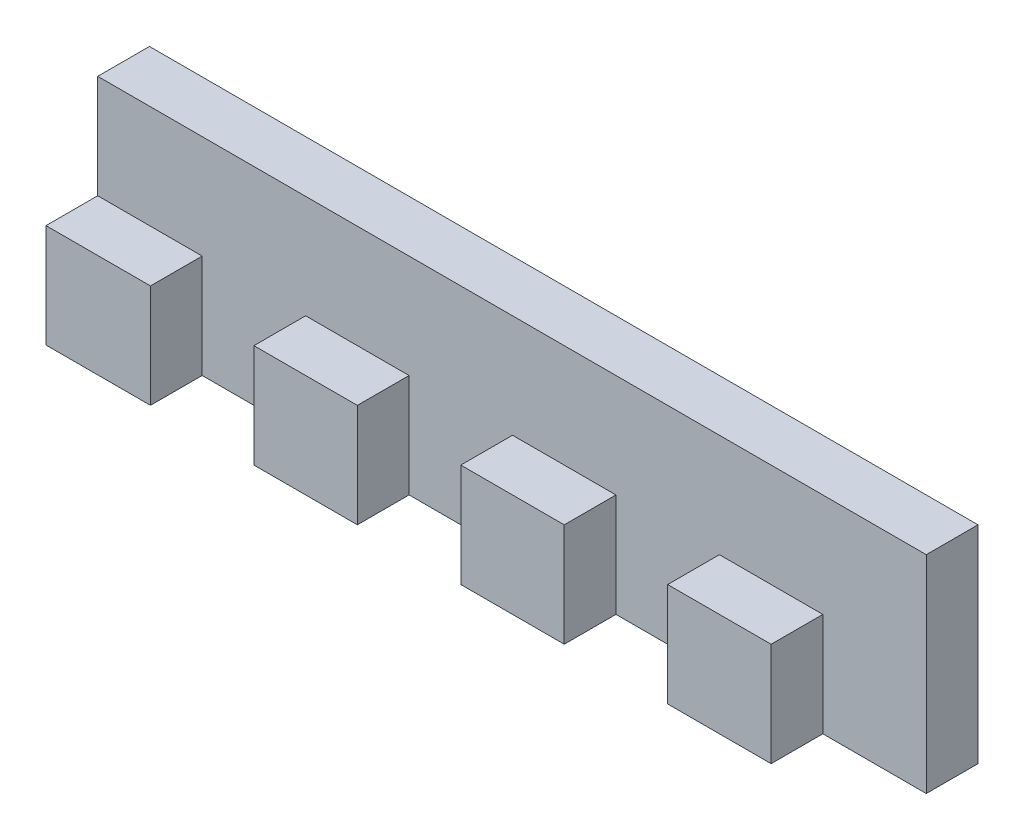
ISO-10303-21;
HEADER;
FILE_DESCRIPTION(('STEP AP214'),'2;1');
FILE_NAME('part.step','',(''),(''),'','','');
FILE_SCHEMA(('AUTOMOTIVE_DESIGN { 1 0 10303 214 1 1 1 1 }'));
ENDSEC;
DATA;
#1=APPLICATION_CONTEXT('core data for automotive mechanical design processes');
#2=APPLICATION_PROTOCOL_DEFINITION('international standard','automotive_design',2000,#1);
#3=PRODUCT_CONTEXT('',#1,'mechanical');
#4=PRODUCT('Part','Part','',(#3));
#5=PRODUCT_RELATED_PRODUCT_CATEGORY('part','',(#4));
#6=PRODUCT_DEFINITION_FORMATION('','',#4);
#7=PRODUCT_DEFINITION_CONTEXT('part definition',#1,'design');
#8=PRODUCT_DEFINITION('design','',#6,#7);
#9=PRODUCT_DEFINITION_SHAPE('','',#8);
#10=(LENGTH_UNIT() NAMED_UNIT(*) SI_UNIT(.MILLI.,.METRE.));
#11=(NAMED_UNIT(*) PLANE_ANGLE_UNIT() SI_UNIT($,.RADIAN.));
#12=(NAMED_UNIT(*) SI_UNIT($,.STERADIAN.) SOLID_ANGLE_UNIT());
#13=UNCERTAINTY_MEASURE_WITH_UNIT(LENGTH_MEASURE(1.E-05),#10,'distance_accuracy_value','');
#14=(GEOMETRIC_REPRESENTATION_CONTEXT(3) GLOBAL_UNCERTAINTY_ASSIGNED_CONTEXT((#13)) GLOBAL_UNIT_ASSIGNED_CONTEXT((#10,
#11,#12)) REPRESENTATION_CONTEXT('',''));
#15=CARTESIAN_POINT('',(0.,0.,0.));
#16=DIRECTION('',(0.,0.,1.));
#17=DIRECTION('',(1.,0.,0.));
#18=AXIS2_PLACEMENT_3D('',#15,#16,#17);
#19=CARTESIAN_POINT('',(0.,20.,-10.));
#20=DIRECTION('',(1.,0.,0.));
#21=DIRECTION('',(0.,0.,-1.));
#22=AXIS2_PLACEMENT_3D('',#19,#20,#21);
#23=PLANE('',#22);
#24=DIRECTION('',(0.,0.,1.));
#25=VECTOR('',#24,1.);
#26=CARTESIAN_POINT('',(0.,10.,-5.));
#27=LINE('',#26,#25);
#28=CARTESIAN_POINT('',(0.,10.,-5.));
#29=VERTEX_POINT('',#28);
#30=CARTESIAN_POINT('',(0.,10.,0.));
#31=VERTEX_POINT('',#30);
#32=EDGE_CURVE('E173',#29,#31,#27,.T.);
#33=ORIENTED_EDGE('',*,*,#32,.F.);
#34=DIRECTION('',(0.,-1.,0.));
#35=VECTOR('',#34,1.);
#36=CARTESIAN_POINT('',(0.,20.,-5.));
#37=LINE('',#36,#35);
#38=CARTESIAN_POINT('',(0.,20.,-5.));
#39=VERTEX_POINT('',#38);
#40=EDGE_CURVE('E183',#39,#29,#37,.T.);
#41=ORIENTED_EDGE('',*,*,#40,.F.);
#42=DIRECTION('',(0.,0.,1.));
#43=VECTOR('',#42,1.);
#44=CARTESIAN_POINT('',(0.,20.,-10.));
#45=LINE('',#44,#43);
#46=CARTESIAN_POINT('',(0.,20.,-10.));
#47=VERTEX_POINT('',#46);
#48=EDGE_CURVE('E217',#47,#39,#45,.T.);
#49=ORIENTED_EDGE('',*,*,#48,.F.);
#50=DIRECTION('',(0.,-1.,0.));
#51=VECTOR('',#50,1.);
#52=CARTESIAN_POINT('',(0.,20.,-10.));
#53=LINE('',#52,#51);
#54=CARTESIAN_POINT('',(0.,0.,-10.));
#55=VERTEX_POINT('',#54);
#56=EDGE_CURVE('E223',#47,#55,#53,.T.);
#57=ORIENTED_EDGE('',*,*,#56,.T.);
#58=DIRECTION('',(0.,0.,1.));
#59=VECTOR('',#58,1.);
#60=CARTESIAN_POINT('',(0.,0.,-10.));
#61=LINE('',#60,#59);
#62=CARTESIAN_POINT('',(0.,0.,0.));
#63=VERTEX_POINT('',#62);
#64=EDGE_CURVE('E216',#55,#63,#61,.T.);
#65=ORIENTED_EDGE('',*,*,#64,.T.);
#66=DIRECTION('',(0.,-1.,0.));
#67=VECTOR('',#66,1.);
#68=CARTESIAN_POINT('',(0.,20.,0.));
#69=LINE('',#68,#67);
#70=EDGE_CURVE('E11',#31,#63,#69,.T.);
#71=ORIENTED_EDGE('',*,*,#70,.F.);
#72=EDGE_LOOP('',(#33,#41,#49,#57,#65,#71));
#73=FACE_BOUND('',#72,.T.);
#74=ADVANCED_FACE('F33',(#73),#23,.F.);
#75=CARTESIAN_POINT('',(0.,20.,0.));
#76=DIRECTION('',(0.,0.,-1.));
#77=DIRECTION('',(-1.,0.,0.));
#78=AXIS2_PLACEMENT_3D('',#75,#76,#77);
#79=PLANE('',#78);
#80=DIRECTION('',(0.,-1.,0.));
#81=VECTOR('',#80,1.);
#82=CARTESIAN_POINT('',(10.0994070024501,20.,0.));
#83=LINE('',#82,#81);
#84=CARTESIAN_POINT('',(10.0994070024501,10.,0.));
#85=VERTEX_POINT('',#84);
#86=CARTESIAN_POINT('',(10.0994070024501,0.,0.));
#87=VERTEX_POINT('',#86);
#88=EDGE_CURVE('E41',#85,#87,#83,.T.);
#89=ORIENTED_EDGE('',*,*,#88,.F.);
#90=DIRECTION('',(-1.,0.,0.));
#91=VECTOR('',#90,1.);
#92=CARTESIAN_POINT('',(80.0994070024501,10.,0.));
#93=LINE('',#92,#91);
#94=EDGE_CURVE('E193',#85,#31,#93,.T.);
#95=ORIENTED_EDGE('',*,*,#94,.T.);
#96=ORIENTED_EDGE('',*,*,#70,.T.);
#97=DIRECTION('',(1.,0.,0.));
#98=VECTOR('',#97,1.);
#99=CARTESIAN_POINT('',(0.,0.,0.));
#100=LINE('',#99,#98);
#101=EDGE_CURVE('E225',#63,#87,#100,.T.);
#102=ORIENTED_EDGE('',*,*,#101,.T.);
#103=EDGE_LOOP('',(#89,#95,#96,#102));
#104=FACE_BOUND('',#103,.T.);
#105=ADVANCED_FACE('F308',(#104),#79,.F.);
#106=CARTESIAN_POINT('',(10.0994070024501,20.,0.));
#107=DIRECTION('',(-1.,0.,0.));
#108=DIRECTION('',(0.,0.,1.));
#109=AXIS2_PLACEMENT_3D('',#106,#107,#108);
#110=PLANE('',#109);
#111=DIRECTION('',(0.,-1.,0.));
#112=VECTOR('',#111,1.);
#113=CARTESIAN_POINT('',(10.0994070024501,20.,-5.));
#114=LINE('',#113,#112);
#115=CARTESIAN_POINT('',(10.0994070024501,10.,-5.));
#116=VERTEX_POINT('',#115);
#117=CARTESIAN_POINT('',(10.0994070024501,0.,-5.));
#118=VERTEX_POINT('',#117);
#119=EDGE_CURVE('E300',#116,#118,#114,.T.);
#120=ORIENTED_EDGE('',*,*,#119,.F.);
#121=DIRECTION('',(0.,0.,1.));
#122=VECTOR('',#121,1.);
#123=CARTESIAN_POINT('',(10.0994070024501,10.,0.));
#124=LINE('',#123,#122);
#125=EDGE_CURVE('E176',#116,#85,#124,.T.);
#126=ORIENTED_EDGE('',*,*,#125,.T.);
#127=ORIENTED_EDGE('',*,*,#88,.T.);
#128=DIRECTION('',(0.,0.,-1.));
#129=VECTOR('',#128,1.);
#130=CARTESIAN_POINT('',(10.0994070024501,0.,0.));
#131=LINE('',#130,#129);
#132=EDGE_CURVE('E228',#87,#118,#131,.T.);
#133=ORIENTED_EDGE('',*,*,#132,.T.);
#134=EDGE_LOOP('',(#120,#126,#127,#133));
#135=FACE_BOUND('',#134,.T.);
#136=ADVANCED_FACE('F303',(#135),#110,.F.);
#137=CARTESIAN_POINT('',(20.0994070024501,20.,-5.));
#138=DIRECTION('',(1.,0.,0.));
#139=DIRECTION('',(0.,0.,-1.));
#140=AXIS2_PLACEMENT_3D('',#137,#138,#139);
#141=PLANE('',#140);
#142=DIRECTION('',(0.,-1.,0.));
#143=VECTOR('',#142,1.);
#144=CARTESIAN_POINT('',(20.0994070024501,20.,0.));
#145=LINE('',#144,#143);
#146=CARTESIAN_POINT('',(20.0994070024501,10.,0.));
#147=VERTEX_POINT('',#146);
#148=CARTESIAN_POINT('',(20.0994070024501,0.,0.));
#149=VERTEX_POINT('',#148);
#150=EDGE_CURVE('E296',#147,#149,#145,.T.);
#151=ORIENTED_EDGE('',*,*,#150,.F.);
#152=DIRECTION('',(0.,0.,-1.));
#153=VECTOR('',#152,1.);
#154=CARTESIAN_POINT('',(20.0994070024501,10.,-5.));
#155=LINE('',#154,#153);
#156=CARTESIAN_POINT('',(20.0994070024501,10.,-5.));
#157=VERTEX_POINT('',#156);
#158=EDGE_CURVE('E212',#147,#157,#155,.T.);
#159=ORIENTED_EDGE('',*,*,#158,.T.);
#160=DIRECTION('',(0.,-1.,0.));
#161=VECTOR('',#160,1.);
#162=CARTESIAN_POINT('',(20.0994070024501,20.,-5.));
#163=LINE('',#162,#161);
#164=CARTESIAN_POINT('',(20.0994070024501,0.,-5.));
#165=VERTEX_POINT('',#164);
#166=EDGE_CURVE('E298',#157,#165,#163,.T.);
#167=ORIENTED_EDGE('',*,*,#166,.T.);
#168=DIRECTION('',(0.,0.,1.));
#169=VECTOR('',#168,1.);
#170=CARTESIAN_POINT('',(20.0994070024501,0.,-5.));
#171=LINE('',#170,#169);
#172=EDGE_CURVE('E234',#165,#149,#171,.T.);
#173=ORIENTED_EDGE('',*,*,#172,.T.);
#174=EDGE_LOOP('',(#151,#159,#167,#173));
#175=FACE_BOUND('',#174,.T.);
#176=ADVANCED_FACE('F319',(#175),#141,.F.);
#177=CARTESIAN_POINT('',(20.0994070024501,20.,0.));
#178=DIRECTION('',(0.,0.,-1.));
#179=DIRECTION('',(-1.,0.,0.));
#180=AXIS2_PLACEMENT_3D('',#177,#178,#179);
#181=PLANE('',#180);
#182=DIRECTION('',(0.,-1.,0.));
#183=VECTOR('',#182,1.);
#184=CARTESIAN_POINT('',(30.0994070024501,20.,0.));
#185=LINE('',#184,#183);
#186=CARTESIAN_POINT('',(30.0994070024501,10.,0.));
#187=VERTEX_POINT('',#186);
#188=CARTESIAN_POINT('',(30.0994070024501,0.,0.));
#189=VERTEX_POINT('',#188);
#190=EDGE_CURVE('E294',#187,#189,#185,.T.);
#191=ORIENTED_EDGE('',*,*,#190,.F.);
#192=EDGE_CURVE('E194',#187,#147,#93,.T.);
#193=ORIENTED_EDGE('',*,*,#192,.T.);
#194=ORIENTED_EDGE('',*,*,#150,.T.);
#195=DIRECTION('',(1.,0.,0.));
#196=VECTOR('',#195,1.);
#197=CARTESIAN_POINT('',(20.0994070024501,0.,0.));
#198=LINE('',#197,#196);
#199=EDGE_CURVE('E237',#149,#189,#198,.T.);
#200=ORIENTED_EDGE('',*,*,#199,.T.);
#201=EDGE_LOOP('',(#191,#193,#194,#200));
#202=FACE_BOUND('',#201,.T.);
#203=ADVANCED_FACE('F325',(#202),#181,.F.);
#204=CARTESIAN_POINT('',(30.0994070024501,20.,0.));
#205=DIRECTION('',(-1.,0.,0.));
#206=DIRECTION('',(0.,0.,1.));
#207=AXIS2_PLACEMENT_3D('',#204,#205,#206);
#208=PLANE('',#207);
#209=DIRECTION('',(0.,-1.,0.));
#210=VECTOR('',#209,1.);
#211=CARTESIAN_POINT('',(30.0994070024501,20.,-5.));
#212=LINE('',#211,#210);
#213=CARTESIAN_POINT('',(30.0994070024501,10.,-5.));
#214=VERTEX_POINT('',#213);
#215=CARTESIAN_POINT('',(30.0994070024501,0.,-5.));
#216=VERTEX_POINT('',#215);
#217=EDGE_CURVE('E292',#214,#216,#212,.T.);
#218=ORIENTED_EDGE('',*,*,#217,.F.);
#219=DIRECTION('',(0.,0.,1.));
#220=VECTOR('',#219,1.);
#221=CARTESIAN_POINT('',(30.0994070024501,10.,0.));
#222=LINE('',#221,#220);
#223=EDGE_CURVE('E209',#214,#187,#222,.T.);
#224=ORIENTED_EDGE('',*,*,#223,.T.);
#225=ORIENTED_EDGE('',*,*,#190,.T.);
#226=DIRECTION('',(0.,0.,-1.));
#227=VECTOR('',#226,1.);
#228=CARTESIAN_POINT('',(30.0994070024501,0.,0.));
#229=LINE('',#228,#227);
#230=EDGE_CURVE('E240',#189,#216,#229,.T.);
#231=ORIENTED_EDGE('',*,*,#230,.T.);
#232=EDGE_LOOP('',(#218,#224,#225,#231));
#233=FACE_BOUND('',#232,.T.);
#234=ADVANCED_FACE('F387',(#233),#208,.F.);
#235=CARTESIAN_POINT('',(40.0994070024501,20.,-5.));
#236=DIRECTION('',(1.,0.,0.));
#237=DIRECTION('',(0.,0.,-1.));
#238=AXIS2_PLACEMENT_3D('',#235,#236,#237);
#239=PLANE('',#238);
#240=DIRECTION('',(0.,-1.,0.));
#241=VECTOR('',#240,1.);
#242=CARTESIAN_POINT('',(40.0994070024501,20.,0.));
#243=LINE('',#242,#241);
#244=CARTESIAN_POINT('',(40.0994070024501,10.,0.));
#245=VERTEX_POINT('',#244);
#246=CARTESIAN_POINT('',(40.0994070024501,0.,0.));
#247=VERTEX_POINT('',#246);
#248=EDGE_CURVE('E288',#245,#247,#243,.T.);
#249=ORIENTED_EDGE('',*,*,#248,.F.);
#250=DIRECTION('',(0.,0.,-1.));
#251=VECTOR('',#250,1.);
#252=CARTESIAN_POINT('',(40.0994070024501,10.,-5.));
#253=LINE('',#252,#251);
#254=CARTESIAN_POINT('',(40.0994070024501,10.,-5.));
#255=VERTEX_POINT('',#254);
#256=EDGE_CURVE('E206',#245,#255,#253,.T.);
#257=ORIENTED_EDGE('',*,*,#256,.T.);
#258=DIRECTION('',(0.,-1.,0.));
#259=VECTOR('',#258,1.);
#260=CARTESIAN_POINT('',(40.0994070024501,20.,-5.));
#261=LINE('',#260,#259);
#262=CARTESIAN_POINT('',(40.0994070024501,0.,-5.));
#263=VERTEX_POINT('',#262);
#264=EDGE_CURVE('E290',#255,#263,#261,.T.);
#265=ORIENTED_EDGE('',*,*,#264,.T.);
#266=DIRECTION('',(0.,0.,1.));
#267=VECTOR('',#266,1.);
#268=CARTESIAN_POINT('',(40.0994070024501,0.,-5.));
#269=LINE('',#268,#267);
#270=EDGE_CURVE('E246',#263,#247,#269,.T.);
#271=ORIENTED_EDGE('',*,*,#270,.T.);
#272=EDGE_LOOP('',(#249,#257,#265,#271));
#273=FACE_BOUND('',#272,.T.);
#274=ADVANCED_FACE('F357',(#273),#239,.F.);
#275=CARTESIAN_POINT('',(40.0994070024501,20.,0.));
#276=DIRECTION('',(0.,0.,-1.));
#277=DIRECTION('',(-1.,0.,0.));
#278=AXIS2_PLACEMENT_3D('',#275,#276,#277);
#279=PLANE('',#278);
#280=DIRECTION('',(0.,-1.,0.));
#281=VECTOR('',#280,1.);
#282=CARTESIAN_POINT('',(50.0994070024501,20.,0.));
#283=LINE('',#282,#281);
#284=CARTESIAN_POINT('',(50.0994070024501,10.,0.));
#285=VERTEX_POINT('',#284);
#286=CARTESIAN_POINT('',(50.0994070024501,0.,0.));
#287=VERTEX_POINT('',#286);
#288=EDGE_CURVE('E286',#285,#287,#283,.T.);
#289=ORIENTED_EDGE('',*,*,#288,.F.);
#290=EDGE_CURVE('E326',#285,#245,#93,.T.);
#291=ORIENTED_EDGE('',*,*,#290,.T.);
#292=ORIENTED_EDGE('',*,*,#248,.T.);
#293=DIRECTION('',(1.,0.,0.));
#294=VECTOR('',#293,1.);
#295=CARTESIAN_POINT('',(40.0994070024501,0.,0.));
#296=LINE('',#295,#294);
#297=EDGE_CURVE('E249',#247,#287,#296,.T.);
#298=ORIENTED_EDGE('',*,*,#297,.T.);
#299=EDGE_LOOP('',(#289,#291,#292,#298));
#300=FACE_BOUND('',#299,.T.);
#301=ADVANCED_FACE('F363',(#300),#279,.F.);
#302=CARTESIAN_POINT('',(50.0994070024501,20.,0.));
#303=DIRECTION('',(-1.,0.,0.));
#304=DIRECTION('',(0.,0.,1.));
#305=AXIS2_PLACEMENT_3D('',#302,#303,#304);
#306=PLANE('',#305);
#307=DIRECTION('',(0.,-1.,0.));
#308=VECTOR('',#307,1.);
#309=CARTESIAN_POINT('',(50.0994070024501,20.,-5.));
#310=LINE('',#309,#308);
#311=CARTESIAN_POINT('',(50.0994070024501,10.,-5.));
#312=VERTEX_POINT('',#311);
#313=CARTESIAN_POINT('',(50.0994070024501,0.,-5.));
#314=VERTEX_POINT('',#313);
#315=EDGE_CURVE('E284',#312,#314,#310,.T.);
#316=ORIENTED_EDGE('',*,*,#315,.F.);
#317=DIRECTION('',(0.,0.,1.));
#318=VECTOR('',#317,1.);
#319=CARTESIAN_POINT('',(50.0994070024501,10.,0.));
#320=LINE('',#319,#318);
#321=EDGE_CURVE('E203',#312,#285,#320,.T.);
#322=ORIENTED_EDGE('',*,*,#321,.T.);
#323=ORIENTED_EDGE('',*,*,#288,.T.);
#324=DIRECTION('',(0.,0.,-1.));
#325=VECTOR('',#324,1.);
#326=CARTESIAN_POINT('',(50.0994070024501,0.,0.));
#327=LINE('',#326,#325);
#328=EDGE_CURVE('E252',#287,#314,#327,.T.);
#329=ORIENTED_EDGE('',*,*,#328,.T.);
#330=EDGE_LOOP('',(#316,#322,#323,#329));
#331=FACE_BOUND('',#330,.T.);
#332=ADVANCED_FACE('F365',(#331),#306,.F.);
#333=CARTESIAN_POINT('',(60.0994070024501,20.,-5.));
#334=DIRECTION('',(1.,0.,0.));
#335=DIRECTION('',(0.,0.,-1.));
#336=AXIS2_PLACEMENT_3D('',#333,#334,#335);
#337=PLANE('',#336);
#338=DIRECTION('',(0.,-1.,0.));
#339=VECTOR('',#338,1.);
#340=CARTESIAN_POINT('',(60.0994070024501,20.,0.));
#341=LINE('',#340,#339);
#342=CARTESIAN_POINT('',(60.0994070024501,10.,0.));
#343=VERTEX_POINT('',#342);
#344=CARTESIAN_POINT('',(60.0994070024501,0.,0.));
#345=VERTEX_POINT('',#344);
#346=EDGE_CURVE('E280',#343,#345,#341,.T.);
#347=ORIENTED_EDGE('',*,*,#346,.F.);
#348=DIRECTION('',(0.,0.,-1.));
#349=VECTOR('',#348,1.);
#350=CARTESIAN_POINT('',(60.0994070024501,10.,-5.));
#351=LINE('',#350,#349);
#352=CARTESIAN_POINT('',(60.0994070024501,10.,-5.));
#353=VERTEX_POINT('',#352);
#354=EDGE_CURVE('E200',#343,#353,#351,.T.);
#355=ORIENTED_EDGE('',*,*,#354,.T.);
#356=DIRECTION('',(0.,-1.,0.));
#357=VECTOR('',#356,1.);
#358=CARTESIAN_POINT('',(60.0994070024501,20.,-5.));
#359=LINE('',#358,#357);
#360=CARTESIAN_POINT('',(60.0994070024501,0.,-5.));
#361=VERTEX_POINT('',#360);
#362=EDGE_CURVE('E282',#353,#361,#359,.T.);
#363=ORIENTED_EDGE('',*,*,#362,.T.);
#364=DIRECTION('',(0.,0.,1.));
#365=VECTOR('',#364,1.);
#366=CARTESIAN_POINT('',(60.0994070024501,0.,-5.));
#367=LINE('',#366,#365);
#368=EDGE_CURVE('E258',#361,#345,#367,.T.);
#369=ORIENTED_EDGE('',*,*,#368,.T.);
#370=EDGE_LOOP('',(#347,#355,#363,#369));
#371=FACE_BOUND('',#370,.T.);
#372=ADVANCED_FACE('F338',(#371),#337,.F.);
#373=CARTESIAN_POINT('',(60.0994070024501,20.,0.));
#374=DIRECTION('',(0.,0.,-1.));
#375=DIRECTION('',(-1.,0.,0.));
#376=AXIS2_PLACEMENT_3D('',#373,#374,#375);
#377=PLANE('',#376);
#378=DIRECTION('',(0.,-1.,0.));
#379=VECTOR('',#378,1.);
#380=CARTESIAN_POINT('',(70.0994070024501,20.,0.));
#381=LINE('',#380,#379);
#382=CARTESIAN_POINT('',(70.0994070024501,10.,0.));
#383=VERTEX_POINT('',#382);
#384=CARTESIAN_POINT('',(70.0994070024501,0.,0.));
#385=VERTEX_POINT('',#384);
#386=EDGE_CURVE('E278',#383,#385,#381,.T.);
#387=ORIENTED_EDGE('',*,*,#386,.F.);
#388=EDGE_CURVE('E195',#383,#343,#93,.T.);
#389=ORIENTED_EDGE('',*,*,#388,.T.);
#390=ORIENTED_EDGE('',*,*,#346,.T.);
#391=DIRECTION('',(1.,0.,0.));
#392=VECTOR('',#391,1.);
#393=CARTESIAN_POINT('',(60.0994070024501,0.,0.));
#394=LINE('',#393,#392);
#395=EDGE_CURVE('E261',#345,#385,#394,.T.);
#396=ORIENTED_EDGE('',*,*,#395,.T.);
#397=EDGE_LOOP('',(#387,#389,#390,#396));
#398=FACE_BOUND('',#397,.T.);
#399=ADVANCED_FACE('F335',(#398),#377,.F.);
#400=CARTESIAN_POINT('',(70.0994070024501,20.,0.));
#401=DIRECTION('',(-1.,0.,0.));
#402=DIRECTION('',(0.,0.,1.));
#403=AXIS2_PLACEMENT_3D('',#400,#401,#402);
#404=PLANE('',#403);
#405=DIRECTION('',(0.,-1.,0.));
#406=VECTOR('',#405,1.);
#407=CARTESIAN_POINT('',(70.0994070024501,20.,-5.));
#408=LINE('',#407,#406);
#409=CARTESIAN_POINT('',(70.0994070024501,10.,-5.));
#410=VERTEX_POINT('',#409);
#411=CARTESIAN_POINT('',(70.0994070024501,0.,-5.));
#412=VERTEX_POINT('',#411);
#413=EDGE_CURVE('E276',#410,#412,#408,.T.);
#414=ORIENTED_EDGE('',*,*,#413,.F.);
#415=DIRECTION('',(0.,0.,1.));
#416=VECTOR('',#415,1.);
#417=CARTESIAN_POINT('',(70.0994070024501,10.,0.));
#418=LINE('',#417,#416);
#419=EDGE_CURVE('E197',#410,#383,#418,.T.);
#420=ORIENTED_EDGE('',*,*,#419,.T.);
#421=ORIENTED_EDGE('',*,*,#386,.T.);
#422=DIRECTION('',(0.,0.,-1.));
#423=VECTOR('',#422,1.);
#424=CARTESIAN_POINT('',(70.0994070024501,0.,0.));
#425=LINE('',#424,#423);
#426=EDGE_CURVE('E264',#385,#412,#425,.T.);
#427=ORIENTED_EDGE('',*,*,#426,.T.);
#428=EDGE_LOOP('',(#414,#420,#421,#427));
#429=FACE_BOUND('',#428,.T.);
#430=ADVANCED_FACE('F347',(#429),#404,.F.);
#431=CARTESIAN_POINT('',(70.0994070024501,20.,-5.));
#432=DIRECTION('',(0.,0.,-1.));
#433=DIRECTION('',(-1.,0.,0.));
#434=AXIS2_PLACEMENT_3D('',#431,#432,#433);
#435=PLANE('',#434);
#436=DIRECTION('',(1.,0.,0.));
#437=VECTOR('',#436,1.);
#438=CARTESIAN_POINT('',(70.0994070024501,0.,-5.));
#439=LINE('',#438,#437);
#440=CARTESIAN_POINT('',(80.0994070024501,0.,-5.));
#441=VERTEX_POINT('',#440);
#442=EDGE_CURVE('E267',#412,#441,#439,.T.);
#443=ORIENTED_EDGE('',*,*,#442,.T.);
#444=DIRECTION('',(0.,-1.,0.));
#445=VECTOR('',#444,1.);
#446=CARTESIAN_POINT('',(80.0994070024501,20.,-5.));
#447=LINE('',#446,#445);
#448=CARTESIAN_POINT('',(80.0994070024501,20.,-5.));
#449=VERTEX_POINT('',#448);
#450=EDGE_CURVE('E274',#449,#441,#447,.T.);
#451=ORIENTED_EDGE('',*,*,#450,.F.);
#452=DIRECTION('',(1.,0.,0.));
#453=VECTOR('',#452,1.);
#454=CARTESIAN_POINT('',(10.0994070024501,20.,-5.));
#455=LINE('',#454,#453);
#456=EDGE_CURVE('E116',#39,#449,#455,.T.);
#457=ORIENTED_EDGE('',*,*,#456,.F.);
#458=ORIENTED_EDGE('',*,*,#40,.T.);
#459=DIRECTION('',(-1.,0.,0.));
#460=VECTOR('',#459,1.);
#461=CARTESIAN_POINT('',(80.0994070024501,10.,-5.));
#462=LINE('',#461,#460);
#463=EDGE_CURVE('E169',#116,#29,#462,.T.);
#464=ORIENTED_EDGE('',*,*,#463,.F.);
#465=ORIENTED_EDGE('',*,*,#119,.T.);
#466=DIRECTION('',(1.,0.,0.));
#467=VECTOR('',#466,1.);
#468=CARTESIAN_POINT('',(10.0994070024501,0.,-5.));
#469=LINE('',#468,#467);
#470=EDGE_CURVE('E231',#118,#165,#469,.T.);
#471=ORIENTED_EDGE('',*,*,#470,.T.);
#472=ORIENTED_EDGE('',*,*,#166,.F.);
#473=EDGE_CURVE('E179',#214,#157,#462,.T.);
#474=ORIENTED_EDGE('',*,*,#473,.F.);
#475=ORIENTED_EDGE('',*,*,#217,.T.);
#476=DIRECTION('',(1.,0.,0.));
#477=VECTOR('',#476,1.);
#478=CARTESIAN_POINT('',(30.0994070024501,0.,-5.));
#479=LINE('',#478,#477);
#480=EDGE_CURVE('E243',#216,#263,#479,.T.);
#481=ORIENTED_EDGE('',*,*,#480,.T.);
#482=ORIENTED_EDGE('',*,*,#264,.F.);
#483=EDGE_CURVE('E350',#312,#255,#462,.T.);
#484=ORIENTED_EDGE('',*,*,#483,.F.);
#485=ORIENTED_EDGE('',*,*,#315,.T.);
#486=DIRECTION('',(1.,0.,0.));
#487=VECTOR('',#486,1.);
#488=CARTESIAN_POINT('',(50.0994070024501,0.,-5.));
#489=LINE('',#488,#487);
#490=EDGE_CURVE('E255',#314,#361,#489,.T.);
#491=ORIENTED_EDGE('',*,*,#490,.T.);
#492=ORIENTED_EDGE('',*,*,#362,.F.);
#493=EDGE_CURVE('E181',#410,#353,#462,.T.);
#494=ORIENTED_EDGE('',*,*,#493,.F.);
#495=ORIENTED_EDGE('',*,*,#413,.T.);
#496=EDGE_LOOP('',(#443,#451,#457,#458,#464,#465,#471,#472,#474,#475,#481,#482,#484,#485,#491,
#492,#494,#495));
#497=FACE_BOUND('',#496,.T.);
#498=ADVANCED_FACE('F185',(#497),#435,.F.);
#499=CARTESIAN_POINT('',(80.0994070024501,20.,-5.));
#500=DIRECTION('',(-1.,0.,0.));
#501=DIRECTION('',(0.,0.,1.));
#502=AXIS2_PLACEMENT_3D('',#499,#500,#501);
#503=PLANE('',#502);
#504=DIRECTION('',(0.,0.,-1.));
#505=VECTOR('',#504,1.);
#506=CARTESIAN_POINT('',(80.0994070024501,0.,-5.));
#507=LINE('',#506,#505);
#508=CARTESIAN_POINT('',(80.0994070024501,0.,-10.));
#509=VERTEX_POINT('',#508);
#510=EDGE_CURVE('E107',#441,#509,#507,.T.);
#511=ORIENTED_EDGE('',*,*,#510,.T.);
#512=DIRECTION('',(0.,-1.,0.));
#513=VECTOR('',#512,1.);
#514=CARTESIAN_POINT('',(80.0994070024501,20.,-10.));
#515=LINE('',#514,#513);
#516=CARTESIAN_POINT('',(80.0994070024501,20.,-10.));
#517=VERTEX_POINT('',#516);
#518=EDGE_CURVE('E272',#517,#509,#515,.T.);
#519=ORIENTED_EDGE('',*,*,#518,.F.);
#520=DIRECTION('',(0.,0.,-1.));
#521=VECTOR('',#520,1.);
#522=CARTESIAN_POINT('',(80.0994070024501,20.,-5.));
#523=LINE('',#522,#521);
#524=EDGE_CURVE('E220',#449,#517,#523,.T.);
#525=ORIENTED_EDGE('',*,*,#524,.F.);
#526=ORIENTED_EDGE('',*,*,#450,.T.);
#527=EDGE_LOOP('',(#511,#519,#525,#526));
#528=FACE_BOUND('',#527,.T.);
#529=ADVANCED_FACE('F436',(#528),#503,.F.);
#530=CARTESIAN_POINT('',(80.0994070024501,20.,-10.));
#531=DIRECTION('',(0.,0.,1.));
#532=DIRECTION('',(1.,0.,0.));
#533=AXIS2_PLACEMENT_3D('',#530,#531,#532);
#534=PLANE('',#533);
#535=DIRECTION('',(-1.,0.,0.));
#536=VECTOR('',#535,1.);
#537=CARTESIAN_POINT('',(80.0994070024501,0.,-10.));
#538=LINE('',#537,#536);
#539=EDGE_CURVE('E112',#509,#55,#538,.T.);
#540=ORIENTED_EDGE('',*,*,#539,.T.);
#541=ORIENTED_EDGE('',*,*,#56,.F.);
#542=DIRECTION('',(-1.,0.,0.));
#543=VECTOR('',#542,1.);
#544=CARTESIAN_POINT('',(80.0994070024501,20.,-10.));
#545=LINE('',#544,#543);
#546=EDGE_CURVE('E49',#517,#47,#545,.T.);
#547=ORIENTED_EDGE('',*,*,#546,.F.);
#548=ORIENTED_EDGE('',*,*,#518,.T.);
#549=EDGE_LOOP('',(#540,#541,#547,#548));
#550=FACE_BOUND('',#549,.T.);
#551=ADVANCED_FACE('F447',(#550),#534,.F.);
#552=CARTESIAN_POINT('',(0.,20.,0.));
#553=DIRECTION('',(0.,1.,0.));
#554=DIRECTION('',(0.,0.,1.));
#555=AXIS2_PLACEMENT_3D('',#552,#553,#554);
#556=PLANE('',#555);
#557=ORIENTED_EDGE('',*,*,#456,.T.);
#558=ORIENTED_EDGE('',*,*,#524,.T.);
#559=ORIENTED_EDGE('',*,*,#546,.T.);
#560=ORIENTED_EDGE('',*,*,#48,.T.);
#561=EDGE_LOOP('',(#557,#558,#559,#560));
#562=FACE_BOUND('',#561,.T.);
#563=ADVANCED_FACE('F454',(#562),#556,.T.);
#564=CARTESIAN_POINT('',(0.,0.,0.));
#565=DIRECTION('',(0.,1.,0.));
#566=DIRECTION('',(0.,0.,1.));
#567=AXIS2_PLACEMENT_3D('',#564,#565,#566);
#568=PLANE('',#567);
#569=ORIENTED_EDGE('',*,*,#64,.F.);
#570=ORIENTED_EDGE('',*,*,#539,.F.);
#571=ORIENTED_EDGE('',*,*,#510,.F.);
#572=ORIENTED_EDGE('',*,*,#442,.F.);
#573=ORIENTED_EDGE('',*,*,#426,.F.);
#574=ORIENTED_EDGE('',*,*,#395,.F.);
#575=ORIENTED_EDGE('',*,*,#368,.F.);
#576=ORIENTED_EDGE('',*,*,#490,.F.);
#577=ORIENTED_EDGE('',*,*,#328,.F.);
#578=ORIENTED_EDGE('',*,*,#297,.F.);
#579=ORIENTED_EDGE('',*,*,#270,.F.);
#580=ORIENTED_EDGE('',*,*,#480,.F.);
#581=ORIENTED_EDGE('',*,*,#230,.F.);
#582=ORIENTED_EDGE('',*,*,#199,.F.);
#583=ORIENTED_EDGE('',*,*,#172,.F.);
#584=ORIENTED_EDGE('',*,*,#470,.F.);
#585=ORIENTED_EDGE('',*,*,#132,.F.);
#586=ORIENTED_EDGE('',*,*,#101,.F.);
#587=EDGE_LOOP('',(#569,#570,#571,#572,#573,#574,#575,#576,#577,#578,#579,#580,#581,#582,#583,
#584,#585,#586));
#588=FACE_BOUND('',#587,.T.);
#589=ADVANCED_FACE('F311',(#588),#568,.F.);
#590=CARTESIAN_POINT('',(80.0994070024501,10.,-5.));
#591=DIRECTION('',(0.,-1.,0.));
#592=DIRECTION('',(0.,0.,-1.));
#593=AXIS2_PLACEMENT_3D('',#590,#591,#592);
#594=PLANE('',#593);
#595=ORIENTED_EDGE('',*,*,#463,.T.);
#596=ORIENTED_EDGE('',*,*,#32,.T.);
#597=ORIENTED_EDGE('',*,*,#94,.F.);
#598=ORIENTED_EDGE('',*,*,#125,.F.);
#599=EDGE_LOOP('',(#595,#596,#597,#598));
#600=FACE_BOUND('',#599,.T.);
#601=ADVANCED_FACE('F171',(#600),#594,.F.);
#602=ORIENTED_EDGE('',*,*,#192,.F.);
#603=ORIENTED_EDGE('',*,*,#223,.F.);
#604=ORIENTED_EDGE('',*,*,#473,.T.);
#605=ORIENTED_EDGE('',*,*,#158,.F.);
#606=EDGE_LOOP('',(#602,#603,#604,#605));
#607=FACE_BOUND('',#606,.T.);
#608=ADVANCED_FACE('F322',(#607),#594,.F.);
#609=ORIENTED_EDGE('',*,*,#290,.F.);
#610=ORIENTED_EDGE('',*,*,#321,.F.);
#611=ORIENTED_EDGE('',*,*,#483,.T.);
#612=ORIENTED_EDGE('',*,*,#256,.F.);
#613=EDGE_LOOP('',(#609,#610,#611,#612));
#614=FACE_BOUND('',#613,.T.);
#615=ADVANCED_FACE('F353',(#614),#594,.F.);
#616=ORIENTED_EDGE('',*,*,#388,.F.);
#617=ORIENTED_EDGE('',*,*,#419,.F.);
#618=ORIENTED_EDGE('',*,*,#493,.T.);
#619=ORIENTED_EDGE('',*,*,#354,.F.);
#620=EDGE_LOOP('',(#616,#617,#618,#619));
#621=FACE_BOUND('',#620,.T.);
#622=ADVANCED_FACE('F349',(#621),#594,.F.);
#623=CLOSED_SHELL('',(#74,#105,#136,#176,#203,#234,#274,#301,#332,#372,#399,#430,#498,#529,#551,
#563,#589,#601,#608,#615,#622));
#624=MANIFOLD_SOLID_BREP('B2',#623);
#625=ADVANCED_BREP_SHAPE_REPRESENTATION('',(#18,#624),#14);
#626=SHAPE_DEFINITION_REPRESENTATION(#9,#625);
ENDSEC;
END-ISO-10303-21;
